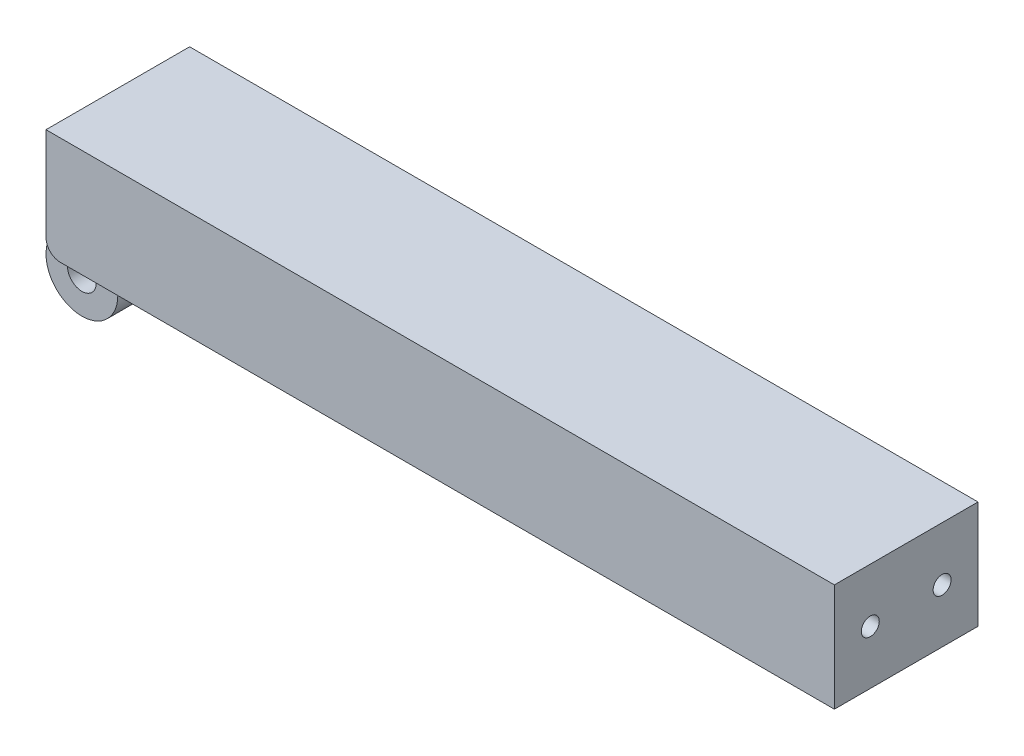
ISO-10303-21;
HEADER;
FILE_DESCRIPTION(('STEP AP214'),'2;1');
FILE_NAME('part.step','',(''),(''),'','','');
FILE_SCHEMA(('AUTOMOTIVE_DESIGN { 1 0 10303 214 1 1 1 1 }'));
ENDSEC;
DATA;
#1=APPLICATION_CONTEXT('core data for automotive mechanical design processes');
#2=APPLICATION_PROTOCOL_DEFINITION('international standard','automotive_design',2000,#1);
#3=PRODUCT_CONTEXT('',#1,'mechanical');
#4=PRODUCT('Part','Part','',(#3));
#5=PRODUCT_RELATED_PRODUCT_CATEGORY('part','',(#4));
#6=PRODUCT_DEFINITION_FORMATION('','',#4);
#7=PRODUCT_DEFINITION_CONTEXT('part definition',#1,'design');
#8=PRODUCT_DEFINITION('design','',#6,#7);
#9=PRODUCT_DEFINITION_SHAPE('','',#8);
#10=(LENGTH_UNIT() NAMED_UNIT(*) SI_UNIT(.MILLI.,.METRE.));
#11=(NAMED_UNIT(*) PLANE_ANGLE_UNIT() SI_UNIT($,.RADIAN.));
#12=(NAMED_UNIT(*) SI_UNIT($,.STERADIAN.) SOLID_ANGLE_UNIT());
#13=UNCERTAINTY_MEASURE_WITH_UNIT(LENGTH_MEASURE(1.E-05),#10,'distance_accuracy_value','');
#14=(GEOMETRIC_REPRESENTATION_CONTEXT(3) GLOBAL_UNCERTAINTY_ASSIGNED_CONTEXT((#13)) GLOBAL_UNIT_ASSIGNED_CONTEXT((#10,
#11,#12)) REPRESENTATION_CONTEXT('',''));
#15=CARTESIAN_POINT('',(0.,0.,0.));
#16=DIRECTION('',(0.,0.,1.));
#17=DIRECTION('',(1.,0.,0.));
#18=AXIS2_PLACEMENT_3D('',#15,#16,#17);
#19=CARTESIAN_POINT('',(109.8,-17.51,10.));
#20=DIRECTION('',(1.,0.,0.));
#21=DIRECTION('',(0.,0.,-1.));
#22=AXIS2_PLACEMENT_3D('',#19,#20,#21);
#23=PLANE('',#22);
#24=DIRECTION('',(0.,-1.,0.));
#25=VECTOR('',#24,1.);
#26=CARTESIAN_POINT('',(109.8,7.5,10.));
#27=LINE('',#26,#25);
#28=CARTESIAN_POINT('',(109.8,7.5,10.));
#29=VERTEX_POINT('',#28);
#30=CARTESIAN_POINT('',(109.8,-7.5,10.));
#31=VERTEX_POINT('',#30);
#32=EDGE_CURVE('E48',#29,#31,#27,.T.);
#33=ORIENTED_EDGE('',*,*,#32,.T.);
#34=DIRECTION('',(0.,0.,-1.));
#35=VECTOR('',#34,1.);
#36=CARTESIAN_POINT('',(109.8,-7.5,10.));
#37=LINE('',#36,#35);
#38=CARTESIAN_POINT('',(109.8,-7.5,-10.));
#39=VERTEX_POINT('',#38);
#40=EDGE_CURVE('E292',#31,#39,#37,.T.);
#41=ORIENTED_EDGE('',*,*,#40,.T.);
#42=DIRECTION('',(0.,1.,0.));
#43=VECTOR('',#42,1.);
#44=CARTESIAN_POINT('',(109.8,-7.5,-10.));
#45=LINE('',#44,#43);
#46=CARTESIAN_POINT('',(109.8,7.5,-10.));
#47=VERTEX_POINT('',#46);
#48=EDGE_CURVE('E145',#39,#47,#45,.T.);
#49=ORIENTED_EDGE('',*,*,#48,.T.);
#50=DIRECTION('',(0.,0.,1.));
#51=VECTOR('',#50,1.);
#52=CARTESIAN_POINT('',(109.8,7.5,10.));
#53=LINE('',#52,#51);
#54=EDGE_CURVE('E289',#47,#29,#53,.T.);
#55=ORIENTED_EDGE('',*,*,#54,.T.);
#56=EDGE_LOOP('',(#33,#41,#49,#55));
#57=FACE_BOUND('',#56,.T.);
#58=CARTESIAN_POINT('',(109.8,0.,-5.00000000000001));
#59=DIRECTION('',(1.,0.,0.));
#60=DIRECTION('',(0.,0.,-1.));
#61=AXIS2_PLACEMENT_3D('',#58,#59,#60);
#62=CIRCLE('',#61,1.24999999999999);
#63=CARTESIAN_POINT('',(109.8,0.,-6.25));
#64=VERTEX_POINT('',#63);
#65=EDGE_CURVE('E295',#64,#64,#62,.F.);
#66=ORIENTED_EDGE('',*,*,#65,.T.);
#67=EDGE_LOOP('',(#66));
#68=FACE_BOUND('',#67,.T.);
#69=CARTESIAN_POINT('',(109.8,0.,5.));
#70=DIRECTION('',(1.,0.,0.));
#71=DIRECTION('',(0.,0.,-1.));
#72=AXIS2_PLACEMENT_3D('',#69,#70,#71);
#73=CIRCLE('',#72,1.24999999999999);
#74=CARTESIAN_POINT('',(109.8,0.,3.75000000000001));
#75=VERTEX_POINT('',#74);
#76=EDGE_CURVE('E137',#75,#75,#73,.F.);
#77=ORIENTED_EDGE('',*,*,#76,.T.);
#78=EDGE_LOOP('',(#77));
#79=FACE_BOUND('',#78,.T.);
#80=ADVANCED_FACE('F44',(#57,#68,#79),#23,.T.);
#81=CARTESIAN_POINT('',(100.8,0.,5.));
#82=DIRECTION('',(1.,0.,0.));
#83=DIRECTION('',(0.,0.,-1.));
#84=AXIS2_PLACEMENT_3D('',#81,#82,#83);
#85=CONICAL_SURFACE('',#84,1.25,1.02974425867666);
#86=CARTESIAN_POINT('',(100.048924226216,0.,5.));
#87=VERTEX_POINT('',#86);
#88=VERTEX_LOOP('',#87);
#89=FACE_BOUND('',#88,.T.);
#90=CARTESIAN_POINT('',(100.8,0.,5.));
#91=DIRECTION('',(1.,0.,0.));
#92=DIRECTION('',(0.,0.,-1.));
#93=AXIS2_PLACEMENT_3D('',#90,#91,#92);
#94=CIRCLE('',#93,1.25);
#95=CARTESIAN_POINT('',(100.8,0.,3.75));
#96=VERTEX_POINT('',#95);
#97=EDGE_CURVE('E216',#96,#96,#94,.T.);
#98=ORIENTED_EDGE('',*,*,#97,.T.);
#99=EDGE_LOOP('',(#98));
#100=FACE_BOUND('',#99,.T.);
#101=ADVANCED_FACE('F361',(#89,#100),#85,.F.);
#102=CARTESIAN_POINT('',(115.8,0.,5.));
#103=DIRECTION('',(1.,0.,0.));
#104=DIRECTION('',(0.,0.,-1.));
#105=AXIS2_PLACEMENT_3D('',#102,#103,#104);
#106=CYLINDRICAL_SURFACE('',#105,1.24999999999999);
#107=ORIENTED_EDGE('',*,*,#97,.F.);
#108=EDGE_LOOP('',(#107));
#109=FACE_BOUND('',#108,.T.);
#110=ORIENTED_EDGE('',*,*,#76,.F.);
#111=EDGE_LOOP('',(#110));
#112=FACE_BOUND('',#111,.T.);
#113=ADVANCED_FACE('F363',(#109,#112),#106,.F.);
#114=CARTESIAN_POINT('',(100.8,0.,-5.00000000000001));
#115=DIRECTION('',(1.,0.,0.));
#116=DIRECTION('',(0.,0.,-1.));
#117=AXIS2_PLACEMENT_3D('',#114,#115,#116);
#118=CONICAL_SURFACE('',#117,1.25,1.02974425867666);
#119=CARTESIAN_POINT('',(100.048924226216,0.,-5.00000000000001));
#120=VERTEX_POINT('',#119);
#121=VERTEX_LOOP('',#120);
#122=FACE_BOUND('',#121,.T.);
#123=CARTESIAN_POINT('',(100.8,0.,-5.00000000000001));
#124=DIRECTION('',(1.,0.,0.));
#125=DIRECTION('',(0.,0.,-1.));
#126=AXIS2_PLACEMENT_3D('',#123,#124,#125);
#127=CIRCLE('',#126,1.25);
#128=CARTESIAN_POINT('',(100.8,0.,-6.25));
#129=VERTEX_POINT('',#128);
#130=EDGE_CURVE('E211',#129,#129,#127,.T.);
#131=ORIENTED_EDGE('',*,*,#130,.T.);
#132=EDGE_LOOP('',(#131));
#133=FACE_BOUND('',#132,.T.);
#134=ADVANCED_FACE('F369',(#122,#133),#118,.F.);
#135=CARTESIAN_POINT('',(115.8,0.,-5.00000000000001));
#136=DIRECTION('',(1.,0.,0.));
#137=DIRECTION('',(0.,0.,-1.));
#138=AXIS2_PLACEMENT_3D('',#135,#136,#137);
#139=CYLINDRICAL_SURFACE('',#138,1.24999999999999);
#140=ORIENTED_EDGE('',*,*,#130,.F.);
#141=EDGE_LOOP('',(#140));
#142=FACE_BOUND('',#141,.T.);
#143=ORIENTED_EDGE('',*,*,#65,.F.);
#144=EDGE_LOOP('',(#143));
#145=FACE_BOUND('',#144,.T.);
#146=ADVANCED_FACE('F471',(#142,#145),#139,.F.);
#147=CARTESIAN_POINT('',(115.8,-7.5,-10.));
#148=DIRECTION('',(0.,0.,1.));
#149=DIRECTION('',(1.,0.,0.));
#150=AXIS2_PLACEMENT_3D('',#147,#148,#149);
#151=PLANE('',#150);
#152=ORIENTED_EDGE('',*,*,#48,.F.);
#153=DIRECTION('',(-1.,0.,0.));
#154=VECTOR('',#153,1.);
#155=CARTESIAN_POINT('',(115.8,-7.5,-10.));
#156=LINE('',#155,#154);
#157=CARTESIAN_POINT('',(2.00000000000003,-7.5,-10.));
#158=VERTEX_POINT('',#157);
#159=EDGE_CURVE('E180',#39,#158,#156,.T.);
#160=ORIENTED_EDGE('',*,*,#159,.T.);
#161=CARTESIAN_POINT('',(2.,-5.5,-10.));
#162=DIRECTION('',(0.,0.,1.));
#163=DIRECTION('',(1.,0.,0.));
#164=AXIS2_PLACEMENT_3D('',#161,#162,#163);
#165=CIRCLE('',#164,2.);
#166=CARTESIAN_POINT('',(0.,-5.5,-10.));
#167=VERTEX_POINT('',#166);
#168=EDGE_CURVE('E166',#158,#167,#165,.F.);
#169=ORIENTED_EDGE('',*,*,#168,.T.);
#170=DIRECTION('',(0.,1.,0.));
#171=VECTOR('',#170,1.);
#172=CARTESIAN_POINT('',(0.,-7.5,-10.));
#173=LINE('',#172,#171);
#174=CARTESIAN_POINT('',(0.,7.5,-10.));
#175=VERTEX_POINT('',#174);
#176=EDGE_CURVE('E187',#167,#175,#173,.T.);
#177=ORIENTED_EDGE('',*,*,#176,.T.);
#178=DIRECTION('',(-1.,0.,0.));
#179=VECTOR('',#178,1.);
#180=CARTESIAN_POINT('',(115.8,7.5,-10.));
#181=LINE('',#180,#179);
#182=EDGE_CURVE('E174',#47,#175,#181,.T.);
#183=ORIENTED_EDGE('',*,*,#182,.F.);
#184=EDGE_LOOP('',(#152,#160,#169,#177,#183));
#185=FACE_BOUND('',#184,.T.);
#186=ADVANCED_FACE('F303',(#185),#151,.F.);
#187=CARTESIAN_POINT('',(115.8,7.5,10.));
#188=DIRECTION('',(0.,-1.,0.));
#189=DIRECTION('',(0.,0.,-1.));
#190=AXIS2_PLACEMENT_3D('',#187,#188,#189);
#191=PLANE('',#190);
#192=ORIENTED_EDGE('',*,*,#54,.F.);
#193=ORIENTED_EDGE('',*,*,#182,.T.);
#194=DIRECTION('',(0.,0.,1.));
#195=VECTOR('',#194,1.);
#196=CARTESIAN_POINT('',(0.,7.5,10.));
#197=LINE('',#196,#195);
#198=CARTESIAN_POINT('',(0.,7.5,10.));
#199=VERTEX_POINT('',#198);
#200=EDGE_CURVE('E184',#175,#199,#197,.T.);
#201=ORIENTED_EDGE('',*,*,#200,.T.);
#202=DIRECTION('',(-1.,0.,0.));
#203=VECTOR('',#202,1.);
#204=CARTESIAN_POINT('',(115.8,7.5,10.));
#205=LINE('',#204,#203);
#206=EDGE_CURVE('E175',#29,#199,#205,.T.);
#207=ORIENTED_EDGE('',*,*,#206,.F.);
#208=EDGE_LOOP('',(#192,#193,#201,#207));
#209=FACE_BOUND('',#208,.T.);
#210=ADVANCED_FACE('F335',(#209),#191,.F.);
#211=CARTESIAN_POINT('',(115.8,-7.5,10.));
#212=DIRECTION('',(0.,1.,0.));
#213=DIRECTION('',(0.,0.,1.));
#214=AXIS2_PLACEMENT_3D('',#211,#212,#213);
#215=PLANE('',#214);
#216=CARTESIAN_POINT('',(40.,-7.5,0.));
#217=DIRECTION('',(0.,-1.,0.));
#218=DIRECTION('',(0.,0.,-1.));
#219=AXIS2_PLACEMENT_3D('',#216,#217,#218);
#220=CIRCLE('',#219,2.1);
#221=CARTESIAN_POINT('',(40.,-7.5,-2.1));
#222=VERTEX_POINT('',#221);
#223=EDGE_CURVE('E134',#222,#222,#220,.T.);
#224=ORIENTED_EDGE('',*,*,#223,.F.);
#225=EDGE_LOOP('',(#224));
#226=FACE_BOUND('',#225,.T.);
#227=ORIENTED_EDGE('',*,*,#40,.F.);
#228=DIRECTION('',(-1.,0.,0.));
#229=VECTOR('',#228,1.);
#230=CARTESIAN_POINT('',(115.8,-7.5,10.));
#231=LINE('',#230,#229);
#232=CARTESIAN_POINT('',(2.00000000000003,-7.5,10.));
#233=VERTEX_POINT('',#232);
#234=EDGE_CURVE('E177',#31,#233,#231,.T.);
#235=ORIENTED_EDGE('',*,*,#234,.T.);
#236=DIRECTION('',(0.,0.,-1.));
#237=VECTOR('',#236,1.);
#238=CARTESIAN_POINT('',(2.,-7.5,5.));
#239=LINE('',#238,#237);
#240=CARTESIAN_POINT('',(2.,-7.5,5.));
#241=VERTEX_POINT('',#240);
#242=EDGE_CURVE('E171',#233,#241,#239,.T.);
#243=ORIENTED_EDGE('',*,*,#242,.T.);
#244=DIRECTION('',(-1.,0.,0.));
#245=VECTOR('',#244,1.);
#246=CARTESIAN_POINT('',(0.,-7.5,5.));
#247=LINE('',#246,#245);
#248=CARTESIAN_POINT('',(9.99999999999999,-7.5,5.));
#249=VERTEX_POINT('',#248);
#250=EDGE_CURVE('E196',#249,#241,#247,.T.);
#251=ORIENTED_EDGE('',*,*,#250,.F.);
#252=DIRECTION('',(0.,0.,-1.));
#253=VECTOR('',#252,1.);
#254=CARTESIAN_POINT('',(9.99999999999999,-7.5,-5.));
#255=LINE('',#254,#253);
#256=CARTESIAN_POINT('',(9.99999999999999,-7.5,-5.));
#257=VERTEX_POINT('',#256);
#258=EDGE_CURVE('E147',#249,#257,#255,.T.);
#259=ORIENTED_EDGE('',*,*,#258,.T.);
#260=DIRECTION('',(-1.,0.,0.));
#261=VECTOR('',#260,1.);
#262=CARTESIAN_POINT('',(0.,-7.5,-5.));
#263=LINE('',#262,#261);
#264=CARTESIAN_POINT('',(2.,-7.5,-5.));
#265=VERTEX_POINT('',#264);
#266=EDGE_CURVE('E197',#257,#265,#263,.T.);
#267=ORIENTED_EDGE('',*,*,#266,.T.);
#268=DIRECTION('',(0.,0.,-1.));
#269=VECTOR('',#268,1.);
#270=CARTESIAN_POINT('',(2.,-7.5,-10.));
#271=LINE('',#270,#269);
#272=EDGE_CURVE('E168',#265,#158,#271,.T.);
#273=ORIENTED_EDGE('',*,*,#272,.T.);
#274=ORIENTED_EDGE('',*,*,#159,.F.);
#275=EDGE_LOOP('',(#227,#235,#243,#251,#259,#267,#273,#274));
#276=FACE_BOUND('',#275,.T.);
#277=ADVANCED_FACE('F46',(#226,#276),#215,.F.);
#278=CARTESIAN_POINT('',(115.8,-7.5,10.));
#279=DIRECTION('',(0.,0.,-1.));
#280=DIRECTION('',(-1.,0.,0.));
#281=AXIS2_PLACEMENT_3D('',#278,#279,#280);
#282=PLANE('',#281);
#283=DIRECTION('',(0.,-1.,0.));
#284=VECTOR('',#283,1.);
#285=CARTESIAN_POINT('',(0.,-7.5,10.));
#286=LINE('',#285,#284);
#287=CARTESIAN_POINT('',(0.,-5.5,10.));
#288=VERTEX_POINT('',#287);
#289=EDGE_CURVE('E181',#199,#288,#286,.T.);
#290=ORIENTED_EDGE('',*,*,#289,.T.);
#291=CARTESIAN_POINT('',(2.,-5.5,10.));
#292=DIRECTION('',(0.,0.,-1.));
#293=DIRECTION('',(-1.,0.,0.));
#294=AXIS2_PLACEMENT_3D('',#291,#292,#293);
#295=CIRCLE('',#294,2.);
#296=EDGE_CURVE('E154',#288,#233,#295,.F.);
#297=ORIENTED_EDGE('',*,*,#296,.T.);
#298=ORIENTED_EDGE('',*,*,#234,.F.);
#299=ORIENTED_EDGE('',*,*,#32,.F.);
#300=ORIENTED_EDGE('',*,*,#206,.T.);
#301=EDGE_LOOP('',(#290,#297,#298,#299,#300));
#302=FACE_BOUND('',#301,.T.);
#303=ADVANCED_FACE('F337',(#302),#282,.F.);
#304=CARTESIAN_POINT('',(0.,0.,0.));
#305=DIRECTION('',(-1.,0.,0.));
#306=DIRECTION('',(0.,0.,1.));
#307=AXIS2_PLACEMENT_3D('',#304,#305,#306);
#308=PLANE('',#307);
#309=CARTESIAN_POINT('',(0.,-3.,2.5));
#310=DIRECTION('',(-1.,0.,0.));
#311=DIRECTION('',(0.,0.,1.));
#312=AXIS2_PLACEMENT_3D('',#309,#310,#311);
#313=CIRCLE('',#312,1.5);
#314=CARTESIAN_POINT('',(0.,-3.,4.));
#315=VERTEX_POINT('',#314);
#316=EDGE_CURVE('E254',#315,#315,#313,.T.);
#317=ORIENTED_EDGE('',*,*,#316,.F.);
#318=EDGE_LOOP('',(#317));
#319=FACE_BOUND('',#318,.T.);
#320=CARTESIAN_POINT('',(0.,-3.,-2.49999999999999));
#321=DIRECTION('',(-1.,0.,0.));
#322=DIRECTION('',(0.,0.,1.));
#323=AXIS2_PLACEMENT_3D('',#320,#321,#322);
#324=CIRCLE('',#323,1.5);
#325=CARTESIAN_POINT('',(0.,-3.,-0.999999999999991));
#326=VERTEX_POINT('',#325);
#327=EDGE_CURVE('E260',#326,#326,#324,.T.);
#328=ORIENTED_EDGE('',*,*,#327,.F.);
#329=EDGE_LOOP('',(#328));
#330=FACE_BOUND('',#329,.T.);
#331=CARTESIAN_POINT('',(0.,1.,7.5));
#332=DIRECTION('',(-1.,0.,0.));
#333=DIRECTION('',(0.,0.,1.));
#334=AXIS2_PLACEMENT_3D('',#331,#332,#333);
#335=CIRCLE('',#334,1.5);
#336=CARTESIAN_POINT('',(0.,1.,9.));
#337=VERTEX_POINT('',#336);
#338=EDGE_CURVE('E266',#337,#337,#335,.T.);
#339=ORIENTED_EDGE('',*,*,#338,.F.);
#340=EDGE_LOOP('',(#339));
#341=FACE_BOUND('',#340,.T.);
#342=CARTESIAN_POINT('',(0.,1.,2.5));
#343=DIRECTION('',(-1.,0.,0.));
#344=DIRECTION('',(0.,0.,1.));
#345=AXIS2_PLACEMENT_3D('',#342,#343,#344);
#346=CIRCLE('',#345,1.5);
#347=CARTESIAN_POINT('',(0.,1.,4.));
#348=VERTEX_POINT('',#347);
#349=EDGE_CURVE('E241',#348,#348,#346,.T.);
#350=ORIENTED_EDGE('',*,*,#349,.F.);
#351=EDGE_LOOP('',(#350));
#352=FACE_BOUND('',#351,.T.);
#353=CARTESIAN_POINT('',(0.,5.,-2.49999999999999));
#354=DIRECTION('',(-1.,0.,0.));
#355=DIRECTION('',(0.,0.,1.));
#356=AXIS2_PLACEMENT_3D('',#353,#354,#355);
#357=CIRCLE('',#356,1.5);
#358=CARTESIAN_POINT('',(0.,5.,-0.999999999999991));
#359=VERTEX_POINT('',#358);
#360=EDGE_CURVE('E223',#359,#359,#357,.T.);
#361=ORIENTED_EDGE('',*,*,#360,.F.);
#362=EDGE_LOOP('',(#361));
#363=FACE_BOUND('',#362,.T.);
#364=CARTESIAN_POINT('',(0.,5.,2.5));
#365=DIRECTION('',(-1.,0.,0.));
#366=DIRECTION('',(0.,0.,1.));
#367=AXIS2_PLACEMENT_3D('',#364,#365,#366);
#368=CIRCLE('',#367,1.5);
#369=CARTESIAN_POINT('',(0.,5.,4.00000000000001));
#370=VERTEX_POINT('',#369);
#371=EDGE_CURVE('E230',#370,#370,#368,.T.);
#372=ORIENTED_EDGE('',*,*,#371,.F.);
#373=EDGE_LOOP('',(#372));
#374=FACE_BOUND('',#373,.T.);
#375=CARTESIAN_POINT('',(0.,5.,7.5));
#376=DIRECTION('',(-1.,0.,0.));
#377=DIRECTION('',(0.,0.,1.));
#378=AXIS2_PLACEMENT_3D('',#375,#376,#377);
#379=CIRCLE('',#378,1.5);
#380=CARTESIAN_POINT('',(0.,5.,9.));
#381=VERTEX_POINT('',#380);
#382=EDGE_CURVE('E229',#381,#381,#379,.T.);
#383=ORIENTED_EDGE('',*,*,#382,.F.);
#384=EDGE_LOOP('',(#383));
#385=FACE_BOUND('',#384,.T.);
#386=CARTESIAN_POINT('',(0.,1.,-2.49999999999999));
#387=DIRECTION('',(-1.,0.,0.));
#388=DIRECTION('',(0.,0.,1.));
#389=AXIS2_PLACEMENT_3D('',#386,#387,#388);
#390=CIRCLE('',#389,1.5);
#391=CARTESIAN_POINT('',(0.,1.,-0.999999999999991));
#392=VERTEX_POINT('',#391);
#393=EDGE_CURVE('E242',#392,#392,#390,.T.);
#394=ORIENTED_EDGE('',*,*,#393,.F.);
#395=EDGE_LOOP('',(#394));
#396=FACE_BOUND('',#395,.T.);
#397=CARTESIAN_POINT('',(0.,-3.,-7.49999999999999));
#398=DIRECTION('',(-1.,0.,0.));
#399=DIRECTION('',(0.,0.,1.));
#400=AXIS2_PLACEMENT_3D('',#397,#398,#399);
#401=CIRCLE('',#400,1.5);
#402=CARTESIAN_POINT('',(0.,-3.,-5.99999999999999));
#403=VERTEX_POINT('',#402);
#404=EDGE_CURVE('E53',#403,#403,#401,.T.);
#405=ORIENTED_EDGE('',*,*,#404,.F.);
#406=EDGE_LOOP('',(#405));
#407=FACE_BOUND('',#406,.T.);
#408=CARTESIAN_POINT('',(0.,1.,-7.49999999999999));
#409=DIRECTION('',(-1.,0.,0.));
#410=DIRECTION('',(0.,0.,1.));
#411=AXIS2_PLACEMENT_3D('',#408,#409,#410);
#412=CIRCLE('',#411,1.5);
#413=CARTESIAN_POINT('',(0.,1.,-5.99999999999999));
#414=VERTEX_POINT('',#413);
#415=EDGE_CURVE('E277',#414,#414,#412,.T.);
#416=ORIENTED_EDGE('',*,*,#415,.F.);
#417=EDGE_LOOP('',(#416));
#418=FACE_BOUND('',#417,.T.);
#419=CARTESIAN_POINT('',(0.,-3.,7.5));
#420=DIRECTION('',(-1.,0.,0.));
#421=DIRECTION('',(0.,0.,1.));
#422=AXIS2_PLACEMENT_3D('',#419,#420,#421);
#423=CIRCLE('',#422,1.5);
#424=CARTESIAN_POINT('',(0.,-3.,9.));
#425=VERTEX_POINT('',#424);
#426=EDGE_CURVE('E253',#425,#425,#423,.T.);
#427=ORIENTED_EDGE('',*,*,#426,.F.);
#428=EDGE_LOOP('',(#427));
#429=FACE_BOUND('',#428,.T.);
#430=CARTESIAN_POINT('',(0.,5.,-7.49999999999999));
#431=DIRECTION('',(-1.,0.,0.));
#432=DIRECTION('',(0.,0.,1.));
#433=AXIS2_PLACEMENT_3D('',#430,#431,#432);
#434=CIRCLE('',#433,1.5);
#435=CARTESIAN_POINT('',(0.,5.,-5.99999999999999));
#436=VERTEX_POINT('',#435);
#437=EDGE_CURVE('E220',#436,#436,#434,.T.);
#438=ORIENTED_EDGE('',*,*,#437,.F.);
#439=EDGE_LOOP('',(#438));
#440=FACE_BOUND('',#439,.T.);
#441=ORIENTED_EDGE('',*,*,#176,.F.);
#442=DIRECTION('',(0.,0.,-1.));
#443=VECTOR('',#442,1.);
#444=CARTESIAN_POINT('',(0.,-5.5,-5.));
#445=LINE('',#444,#443);
#446=CARTESIAN_POINT('',(0.,-5.5,-5.));
#447=VERTEX_POINT('',#446);
#448=EDGE_CURVE('E156',#167,#447,#445,.F.);
#449=ORIENTED_EDGE('',*,*,#448,.T.);
#450=DIRECTION('',(0.,-1.,0.));
#451=VECTOR('',#450,1.);
#452=CARTESIAN_POINT('',(0.,-12.5,-5.));
#453=LINE('',#452,#451);
#454=CARTESIAN_POINT('',(0.,-7.5,-5.));
#455=VERTEX_POINT('',#454);
#456=EDGE_CURVE('E159',#447,#455,#453,.T.);
#457=ORIENTED_EDGE('',*,*,#456,.T.);
#458=DIRECTION('',(0.,0.,-1.));
#459=VECTOR('',#458,1.);
#460=CARTESIAN_POINT('',(0.,-7.5,5.));
#461=LINE('',#460,#459);
#462=CARTESIAN_POINT('',(0.,-7.5,5.));
#463=VERTEX_POINT('',#462);
#464=EDGE_CURVE('E193',#463,#455,#461,.T.);
#465=ORIENTED_EDGE('',*,*,#464,.F.);
#466=DIRECTION('',(0.,1.,0.));
#467=VECTOR('',#466,1.);
#468=CARTESIAN_POINT('',(0.,0.,5.));
#469=LINE('',#468,#467);
#470=CARTESIAN_POINT('',(0.,-5.5,5.));
#471=VERTEX_POINT('',#470);
#472=EDGE_CURVE('E161',#463,#471,#469,.T.);
#473=ORIENTED_EDGE('',*,*,#472,.T.);
#474=DIRECTION('',(0.,0.,-1.));
#475=VECTOR('',#474,1.);
#476=CARTESIAN_POINT('',(0.,-5.5,10.));
#477=LINE('',#476,#475);
#478=EDGE_CURVE('E164',#471,#288,#477,.F.);
#479=ORIENTED_EDGE('',*,*,#478,.T.);
#480=ORIENTED_EDGE('',*,*,#289,.F.);
#481=ORIENTED_EDGE('',*,*,#200,.F.);
#482=EDGE_LOOP('',(#441,#449,#457,#465,#473,#479,#480,#481));
#483=FACE_BOUND('',#482,.T.);
#484=ADVANCED_FACE('F327',(#319,#330,#341,#352,#363,#374,#385,#396,#407,#418,#429,#440,#483),
#308,.T.);
#485=CARTESIAN_POINT('',(0.,-12.5,5.));
#486=DIRECTION('',(0.,0.,1.));
#487=DIRECTION('',(1.,0.,0.));
#488=AXIS2_PLACEMENT_3D('',#485,#486,#487);
#489=PLANE('',#488);
#490=CARTESIAN_POINT('',(0.,-12.5,5.));
#491=DIRECTION('',(0.,0.,1.));
#492=DIRECTION('',(1.,0.,0.));
#493=AXIS2_PLACEMENT_3D('',#490,#491,#492);
#494=CIRCLE('',#493,5.);
#495=CARTESIAN_POINT('',(5.,-12.5,5.));
#496=VERTEX_POINT('',#495);
#497=EDGE_CURVE('E201',#463,#496,#494,.T.);
#498=ORIENTED_EDGE('',*,*,#497,.T.);
#499=CARTESIAN_POINT('',(9.99999999999999,-12.5,5.));
#500=DIRECTION('',(0.,0.,1.));
#501=DIRECTION('',(1.,0.,0.));
#502=AXIS2_PLACEMENT_3D('',#499,#500,#501);
#503=CIRCLE('',#502,5.);
#504=EDGE_CURVE('E141',#496,#249,#503,.F.);
#505=ORIENTED_EDGE('',*,*,#504,.T.);
#506=ORIENTED_EDGE('',*,*,#250,.T.);
#507=CARTESIAN_POINT('',(2.,-5.5,5.));
#508=DIRECTION('',(0.,0.,1.));
#509=DIRECTION('',(1.,0.,0.));
#510=AXIS2_PLACEMENT_3D('',#507,#508,#509);
#511=CIRCLE('',#510,2.);
#512=EDGE_CURVE('E150',#241,#471,#511,.F.);
#513=ORIENTED_EDGE('',*,*,#512,.T.);
#514=ORIENTED_EDGE('',*,*,#472,.F.);
#515=EDGE_LOOP('',(#498,#505,#506,#513,#514));
#516=FACE_BOUND('',#515,.T.);
#517=CARTESIAN_POINT('',(0.,-12.5,5.));
#518=DIRECTION('',(0.,0.,1.));
#519=DIRECTION('',(1.,0.,0.));
#520=AXIS2_PLACEMENT_3D('',#517,#518,#519);
#521=CIRCLE('',#520,2.);
#522=CARTESIAN_POINT('',(2.,-12.5,5.));
#523=VERTEX_POINT('',#522);
#524=EDGE_CURVE('E204',#523,#523,#521,.T.);
#525=ORIENTED_EDGE('',*,*,#524,.F.);
#526=EDGE_LOOP('',(#525));
#527=FACE_BOUND('',#526,.T.);
#528=ADVANCED_FACE('F344',(#516,#527),#489,.T.);
#529=CARTESIAN_POINT('',(0.,-12.5,-5.));
#530=DIRECTION('',(0.,0.,1.));
#531=DIRECTION('',(1.,0.,0.));
#532=AXIS2_PLACEMENT_3D('',#529,#530,#531);
#533=PLANE('',#532);
#534=CARTESIAN_POINT('',(0.,-12.5,-5.));
#535=DIRECTION('',(0.,0.,1.));
#536=DIRECTION('',(1.,0.,0.));
#537=AXIS2_PLACEMENT_3D('',#534,#535,#536);
#538=CIRCLE('',#537,5.);
#539=CARTESIAN_POINT('',(5.,-12.5,-5.));
#540=VERTEX_POINT('',#539);
#541=EDGE_CURVE('E200',#455,#540,#538,.T.);
#542=ORIENTED_EDGE('',*,*,#541,.F.);
#543=ORIENTED_EDGE('',*,*,#456,.F.);
#544=CARTESIAN_POINT('',(2.,-5.5,-5.));
#545=DIRECTION('',(0.,0.,1.));
#546=DIRECTION('',(1.,0.,0.));
#547=AXIS2_PLACEMENT_3D('',#544,#545,#546);
#548=CIRCLE('',#547,2.);
#549=EDGE_CURVE('E152',#447,#265,#548,.T.);
#550=ORIENTED_EDGE('',*,*,#549,.T.);
#551=ORIENTED_EDGE('',*,*,#266,.F.);
#552=CARTESIAN_POINT('',(9.99999999999999,-12.5,-5.));
#553=DIRECTION('',(0.,0.,1.));
#554=DIRECTION('',(1.,0.,0.));
#555=AXIS2_PLACEMENT_3D('',#552,#553,#554);
#556=CIRCLE('',#555,5.);
#557=EDGE_CURVE('E144',#257,#540,#556,.T.);
#558=ORIENTED_EDGE('',*,*,#557,.T.);
#559=EDGE_LOOP('',(#542,#543,#550,#551,#558));
#560=FACE_BOUND('',#559,.T.);
#561=CARTESIAN_POINT('',(0.,-12.5,-5.));
#562=DIRECTION('',(0.,0.,1.));
#563=DIRECTION('',(1.,0.,0.));
#564=AXIS2_PLACEMENT_3D('',#561,#562,#563);
#565=CIRCLE('',#564,2.);
#566=CARTESIAN_POINT('',(2.,-12.5,-5.));
#567=VERTEX_POINT('',#566);
#568=EDGE_CURVE('E208',#567,#567,#565,.T.);
#569=ORIENTED_EDGE('',*,*,#568,.T.);
#570=EDGE_LOOP('',(#569));
#571=FACE_BOUND('',#570,.T.);
#572=ADVANCED_FACE('F316',(#560,#571),#533,.F.);
#573=CARTESIAN_POINT('',(0.,-12.5,5.));
#574=DIRECTION('',(0.,0.,-1.));
#575=DIRECTION('',(-1.,0.,0.));
#576=AXIS2_PLACEMENT_3D('',#573,#574,#575);
#577=CYLINDRICAL_SURFACE('',#576,5.);
#578=ORIENTED_EDGE('',*,*,#541,.T.);
#579=DIRECTION('',(0.,0.,-1.));
#580=VECTOR('',#579,1.);
#581=CARTESIAN_POINT('',(5.,-12.5,5.));
#582=LINE('',#581,#580);
#583=EDGE_CURVE('E190',#496,#540,#582,.T.);
#584=ORIENTED_EDGE('',*,*,#583,.F.);
#585=ORIENTED_EDGE('',*,*,#497,.F.);
#586=ORIENTED_EDGE('',*,*,#464,.T.);
#587=EDGE_LOOP('',(#578,#584,#585,#586));
#588=FACE_BOUND('',#587,.T.);
#589=ADVANCED_FACE('F324',(#588),#577,.T.);
#590=CARTESIAN_POINT('',(0.,-12.5,5.));
#591=DIRECTION('',(0.,0.,-1.));
#592=DIRECTION('',(-1.,0.,0.));
#593=AXIS2_PLACEMENT_3D('',#590,#591,#592);
#594=CYLINDRICAL_SURFACE('',#593,2.);
#595=ORIENTED_EDGE('',*,*,#524,.T.);
#596=EDGE_LOOP('',(#595));
#597=FACE_BOUND('',#596,.T.);
#598=ORIENTED_EDGE('',*,*,#568,.F.);
#599=EDGE_LOOP('',(#598));
#600=FACE_BOUND('',#599,.T.);
#601=ADVANCED_FACE('F350',(#597,#600),#594,.F.);
#602=CARTESIAN_POINT('',(2.,-5.5,10.));
#603=DIRECTION('',(0.,0.,1.));
#604=DIRECTION('',(1.,0.,0.));
#605=AXIS2_PLACEMENT_3D('',#602,#603,#604);
#606=CYLINDRICAL_SURFACE('',#605,2.);
#607=ORIENTED_EDGE('',*,*,#549,.F.);
#608=ORIENTED_EDGE('',*,*,#448,.F.);
#609=ORIENTED_EDGE('',*,*,#168,.F.);
#610=ORIENTED_EDGE('',*,*,#272,.F.);
#611=EDGE_LOOP('',(#607,#608,#609,#610));
#612=FACE_BOUND('',#611,.T.);
#613=ADVANCED_FACE('F311',(#612),#606,.T.);
#614=CARTESIAN_POINT('',(2.,-5.5,10.));
#615=DIRECTION('',(0.,0.,1.));
#616=DIRECTION('',(1.,0.,0.));
#617=AXIS2_PLACEMENT_3D('',#614,#615,#616);
#618=CYLINDRICAL_SURFACE('',#617,2.);
#619=ORIENTED_EDGE('',*,*,#296,.F.);
#620=ORIENTED_EDGE('',*,*,#478,.F.);
#621=ORIENTED_EDGE('',*,*,#512,.F.);
#622=ORIENTED_EDGE('',*,*,#242,.F.);
#623=EDGE_LOOP('',(#619,#620,#621,#622));
#624=FACE_BOUND('',#623,.T.);
#625=ADVANCED_FACE('F341',(#624),#618,.T.);
#626=CARTESIAN_POINT('',(9.99999999999999,-12.5,10.));
#627=DIRECTION('',(0.,0.,1.));
#628=DIRECTION('',(1.,0.,0.));
#629=AXIS2_PLACEMENT_3D('',#626,#627,#628);
#630=CYLINDRICAL_SURFACE('',#629,5.);
#631=ORIENTED_EDGE('',*,*,#504,.F.);
#632=ORIENTED_EDGE('',*,*,#583,.T.);
#633=ORIENTED_EDGE('',*,*,#557,.F.);
#634=ORIENTED_EDGE('',*,*,#258,.F.);
#635=EDGE_LOOP('',(#631,#632,#633,#634));
#636=FACE_BOUND('',#635,.T.);
#637=ADVANCED_FACE('F320',(#636),#630,.F.);
#638=CARTESIAN_POINT('',(2.5,5.,-7.49999999999999));
#639=DIRECTION('',(-1.,0.,0.));
#640=DIRECTION('',(0.,0.,1.));
#641=AXIS2_PLACEMENT_3D('',#638,#639,#640);
#642=CYLINDRICAL_SURFACE('',#641,1.5);
#643=CARTESIAN_POINT('',(2.5,5.,-7.49999999999999));
#644=DIRECTION('',(-1.,0.,0.));
#645=DIRECTION('',(0.,0.,1.));
#646=AXIS2_PLACEMENT_3D('',#643,#644,#645);
#647=CIRCLE('',#646,1.5);
#648=CARTESIAN_POINT('',(2.5,5.,-5.99999999999999));
#649=VERTEX_POINT('',#648);
#650=EDGE_CURVE('E219',#649,#649,#647,.T.);
#651=ORIENTED_EDGE('',*,*,#650,.F.);
#652=EDGE_LOOP('',(#651));
#653=FACE_BOUND('',#652,.T.);
#654=ORIENTED_EDGE('',*,*,#437,.T.);
#655=EDGE_LOOP('',(#654));
#656=FACE_BOUND('',#655,.T.);
#657=ADVANCED_FACE('F376',(#653,#656),#642,.F.);
#658=CARTESIAN_POINT('',(2.5,5.,-7.49999999999999));
#659=DIRECTION('',(-1.,0.,0.));
#660=DIRECTION('',(0.,0.,1.));
#661=AXIS2_PLACEMENT_3D('',#658,#659,#660);
#662=PLANE('',#661);
#663=ORIENTED_EDGE('',*,*,#650,.T.);
#664=EDGE_LOOP('',(#663));
#665=FACE_BOUND('',#664,.T.);
#666=ADVANCED_FACE('F379',(#665),#662,.T.);
#667=CARTESIAN_POINT('',(2.5,-3.,7.5));
#668=DIRECTION('',(-1.,0.,0.));
#669=DIRECTION('',(0.,0.,1.));
#670=AXIS2_PLACEMENT_3D('',#667,#668,#669);
#671=CYLINDRICAL_SURFACE('',#670,1.5);
#672=CARTESIAN_POINT('',(2.5,-3.,7.5));
#673=DIRECTION('',(-1.,0.,0.));
#674=DIRECTION('',(0.,0.,1.));
#675=AXIS2_PLACEMENT_3D('',#672,#673,#674);
#676=CIRCLE('',#675,1.5);
#677=CARTESIAN_POINT('',(2.5,-3.,9.));
#678=VERTEX_POINT('',#677);
#679=EDGE_CURVE('E280',#678,#678,#676,.T.);
#680=ORIENTED_EDGE('',*,*,#679,.F.);
#681=EDGE_LOOP('',(#680));
#682=FACE_BOUND('',#681,.T.);
#683=ORIENTED_EDGE('',*,*,#426,.T.);
#684=EDGE_LOOP('',(#683));
#685=FACE_BOUND('',#684,.T.);
#686=ADVANCED_FACE('F383',(#682,#685),#671,.F.);
#687=CARTESIAN_POINT('',(2.5,-3.,7.5));
#688=DIRECTION('',(-1.,0.,0.));
#689=DIRECTION('',(0.,0.,1.));
#690=AXIS2_PLACEMENT_3D('',#687,#688,#689);
#691=PLANE('',#690);
#692=ORIENTED_EDGE('',*,*,#679,.T.);
#693=EDGE_LOOP('',(#692));
#694=FACE_BOUND('',#693,.T.);
#695=ADVANCED_FACE('F457',(#694),#691,.T.);
#696=CARTESIAN_POINT('',(2.5,1.,-7.49999999999999));
#697=DIRECTION('',(-1.,0.,0.));
#698=DIRECTION('',(0.,0.,1.));
#699=AXIS2_PLACEMENT_3D('',#696,#697,#698);
#700=CYLINDRICAL_SURFACE('',#699,1.5);
#701=CARTESIAN_POINT('',(2.5,1.,-7.49999999999999));
#702=DIRECTION('',(-1.,0.,0.));
#703=DIRECTION('',(0.,0.,1.));
#704=AXIS2_PLACEMENT_3D('',#701,#702,#703);
#705=CIRCLE('',#704,1.5);
#706=CARTESIAN_POINT('',(2.5,1.,-5.99999999999999));
#707=VERTEX_POINT('',#706);
#708=EDGE_CURVE('E274',#707,#707,#705,.T.);
#709=ORIENTED_EDGE('',*,*,#708,.F.);
#710=EDGE_LOOP('',(#709));
#711=FACE_BOUND('',#710,.T.);
#712=ORIENTED_EDGE('',*,*,#415,.T.);
#713=EDGE_LOOP('',(#712));
#714=FACE_BOUND('',#713,.T.);
#715=ADVANCED_FACE('F453',(#711,#714),#700,.F.);
#716=CARTESIAN_POINT('',(2.5,1.,-7.49999999999999));
#717=DIRECTION('',(-1.,0.,0.));
#718=DIRECTION('',(0.,0.,1.));
#719=AXIS2_PLACEMENT_3D('',#716,#717,#718);
#720=PLANE('',#719);
#721=ORIENTED_EDGE('',*,*,#708,.T.);
#722=EDGE_LOOP('',(#721));
#723=FACE_BOUND('',#722,.T.);
#724=ADVANCED_FACE('F449',(#723),#720,.T.);
#725=CARTESIAN_POINT('',(2.5,-3.,-7.49999999999999));
#726=DIRECTION('',(-1.,0.,0.));
#727=DIRECTION('',(0.,0.,1.));
#728=AXIS2_PLACEMENT_3D('',#725,#726,#727);
#729=CYLINDRICAL_SURFACE('',#728,1.5);
#730=CARTESIAN_POINT('',(2.5,-3.,-7.49999999999999));
#731=DIRECTION('',(-1.,0.,0.));
#732=DIRECTION('',(0.,0.,1.));
#733=AXIS2_PLACEMENT_3D('',#730,#731,#732);
#734=CIRCLE('',#733,1.5);
#735=CARTESIAN_POINT('',(2.5,-3.,-5.99999999999999));
#736=VERTEX_POINT('',#735);
#737=EDGE_CURVE('E11',#736,#736,#734,.T.);
#738=ORIENTED_EDGE('',*,*,#737,.F.);
#739=EDGE_LOOP('',(#738));
#740=FACE_BOUND('',#739,.T.);
#741=ORIENTED_EDGE('',*,*,#404,.T.);
#742=EDGE_LOOP('',(#741));
#743=FACE_BOUND('',#742,.T.);
#744=ADVANCED_FACE('F452',(#740,#743),#729,.F.);
#745=CARTESIAN_POINT('',(2.5,-3.,-7.49999999999999));
#746=DIRECTION('',(-1.,0.,0.));
#747=DIRECTION('',(0.,0.,1.));
#748=AXIS2_PLACEMENT_3D('',#745,#746,#747);
#749=PLANE('',#748);
#750=ORIENTED_EDGE('',*,*,#737,.T.);
#751=EDGE_LOOP('',(#750));
#752=FACE_BOUND('',#751,.T.);
#753=ADVANCED_FACE('F411',(#752),#749,.T.);
#754=CARTESIAN_POINT('',(2.5,1.,-2.49999999999999));
#755=DIRECTION('',(-1.,0.,0.));
#756=DIRECTION('',(0.,0.,1.));
#757=AXIS2_PLACEMENT_3D('',#754,#755,#756);
#758=CYLINDRICAL_SURFACE('',#757,1.5);
#759=CARTESIAN_POINT('',(2.5,1.,-2.49999999999999));
#760=DIRECTION('',(-1.,0.,0.));
#761=DIRECTION('',(0.,0.,1.));
#762=AXIS2_PLACEMENT_3D('',#759,#760,#761);
#763=CIRCLE('',#762,1.5);
#764=CARTESIAN_POINT('',(2.5,1.,-0.999999999999991));
#765=VERTEX_POINT('',#764);
#766=EDGE_CURVE('E238',#765,#765,#763,.T.);
#767=ORIENTED_EDGE('',*,*,#766,.F.);
#768=EDGE_LOOP('',(#767));
#769=FACE_BOUND('',#768,.T.);
#770=ORIENTED_EDGE('',*,*,#393,.T.);
#771=EDGE_LOOP('',(#770));
#772=FACE_BOUND('',#771,.T.);
#773=ADVANCED_FACE('F407',(#769,#772),#758,.F.);
#774=CARTESIAN_POINT('',(2.5,1.,-2.49999999999999));
#775=DIRECTION('',(-1.,0.,0.));
#776=DIRECTION('',(0.,0.,1.));
#777=AXIS2_PLACEMENT_3D('',#774,#775,#776);
#778=PLANE('',#777);
#779=ORIENTED_EDGE('',*,*,#766,.T.);
#780=EDGE_LOOP('',(#779));
#781=FACE_BOUND('',#780,.T.);
#782=ADVANCED_FACE('F403',(#781),#778,.T.);
#783=CARTESIAN_POINT('',(2.5,5.,7.5));
#784=DIRECTION('',(-1.,0.,0.));
#785=DIRECTION('',(0.,0.,1.));
#786=AXIS2_PLACEMENT_3D('',#783,#784,#785);
#787=CYLINDRICAL_SURFACE('',#786,1.5);
#788=CARTESIAN_POINT('',(2.5,5.,7.5));
#789=DIRECTION('',(-1.,0.,0.));
#790=DIRECTION('',(0.,0.,1.));
#791=AXIS2_PLACEMENT_3D('',#788,#789,#790);
#792=CIRCLE('',#791,1.5);
#793=CARTESIAN_POINT('',(2.5,5.,9.));
#794=VERTEX_POINT('',#793);
#795=EDGE_CURVE('E245',#794,#794,#792,.T.);
#796=ORIENTED_EDGE('',*,*,#795,.F.);
#797=EDGE_LOOP('',(#796));
#798=FACE_BOUND('',#797,.T.);
#799=ORIENTED_EDGE('',*,*,#382,.T.);
#800=EDGE_LOOP('',(#799));
#801=FACE_BOUND('',#800,.T.);
#802=ADVANCED_FACE('F406',(#798,#801),#787,.F.);
#803=CARTESIAN_POINT('',(2.5,5.,7.5));
#804=DIRECTION('',(-1.,0.,0.));
#805=DIRECTION('',(0.,0.,1.));
#806=AXIS2_PLACEMENT_3D('',#803,#804,#805);
#807=PLANE('',#806);
#808=ORIENTED_EDGE('',*,*,#795,.T.);
#809=EDGE_LOOP('',(#808));
#810=FACE_BOUND('',#809,.T.);
#811=ADVANCED_FACE('F393',(#810),#807,.T.);
#812=CARTESIAN_POINT('',(2.5,5.,2.5));
#813=DIRECTION('',(-1.,0.,0.));
#814=DIRECTION('',(0.,0.,1.));
#815=AXIS2_PLACEMENT_3D('',#812,#813,#814);
#816=CYLINDRICAL_SURFACE('',#815,1.5);
#817=CARTESIAN_POINT('',(2.5,5.,2.5));
#818=DIRECTION('',(-1.,0.,0.));
#819=DIRECTION('',(0.,0.,1.));
#820=AXIS2_PLACEMENT_3D('',#817,#818,#819);
#821=CIRCLE('',#820,1.5);
#822=CARTESIAN_POINT('',(2.5,5.,4.00000000000001));
#823=VERTEX_POINT('',#822);
#824=EDGE_CURVE('E226',#823,#823,#821,.T.);
#825=ORIENTED_EDGE('',*,*,#824,.F.);
#826=EDGE_LOOP('',(#825));
#827=FACE_BOUND('',#826,.T.);
#828=ORIENTED_EDGE('',*,*,#371,.T.);
#829=EDGE_LOOP('',(#828));
#830=FACE_BOUND('',#829,.T.);
#831=ADVANCED_FACE('F389',(#827,#830),#816,.F.);
#832=CARTESIAN_POINT('',(2.5,5.,2.5));
#833=DIRECTION('',(-1.,0.,0.));
#834=DIRECTION('',(0.,0.,1.));
#835=AXIS2_PLACEMENT_3D('',#832,#833,#834);
#836=PLANE('',#835);
#837=ORIENTED_EDGE('',*,*,#824,.T.);
#838=EDGE_LOOP('',(#837));
#839=FACE_BOUND('',#838,.T.);
#840=ADVANCED_FACE('F385',(#839),#836,.T.);
#841=CARTESIAN_POINT('',(2.5,5.,-2.49999999999999));
#842=DIRECTION('',(-1.,0.,0.));
#843=DIRECTION('',(0.,0.,1.));
#844=AXIS2_PLACEMENT_3D('',#841,#842,#843);
#845=CYLINDRICAL_SURFACE('',#844,1.5);
#846=CARTESIAN_POINT('',(2.5,5.,-2.49999999999999));
#847=DIRECTION('',(-1.,0.,0.));
#848=DIRECTION('',(0.,0.,1.));
#849=AXIS2_PLACEMENT_3D('',#846,#847,#848);
#850=CIRCLE('',#849,1.5);
#851=CARTESIAN_POINT('',(2.5,5.,-0.999999999999991));
#852=VERTEX_POINT('',#851);
#853=EDGE_CURVE('E233',#852,#852,#850,.T.);
#854=ORIENTED_EDGE('',*,*,#853,.F.);
#855=EDGE_LOOP('',(#854));
#856=FACE_BOUND('',#855,.T.);
#857=ORIENTED_EDGE('',*,*,#360,.T.);
#858=EDGE_LOOP('',(#857));
#859=FACE_BOUND('',#858,.T.);
#860=ADVANCED_FACE('F388',(#856,#859),#845,.F.);
#861=CARTESIAN_POINT('',(2.5,5.,-2.49999999999999));
#862=DIRECTION('',(-1.,0.,0.));
#863=DIRECTION('',(0.,0.,1.));
#864=AXIS2_PLACEMENT_3D('',#861,#862,#863);
#865=PLANE('',#864);
#866=ORIENTED_EDGE('',*,*,#853,.T.);
#867=EDGE_LOOP('',(#866));
#868=FACE_BOUND('',#867,.T.);
#869=ADVANCED_FACE('F395',(#868),#865,.T.);
#870=CARTESIAN_POINT('',(2.5,1.,2.5));
#871=DIRECTION('',(-1.,0.,0.));
#872=DIRECTION('',(0.,0.,1.));
#873=AXIS2_PLACEMENT_3D('',#870,#871,#872);
#874=CYLINDRICAL_SURFACE('',#873,1.5);
#875=CARTESIAN_POINT('',(2.5,1.,2.5));
#876=DIRECTION('',(-1.,0.,0.));
#877=DIRECTION('',(0.,0.,1.));
#878=AXIS2_PLACEMENT_3D('',#875,#876,#877);
#879=CIRCLE('',#878,1.5);
#880=CARTESIAN_POINT('',(2.5,1.,4.));
#881=VERTEX_POINT('',#880);
#882=EDGE_CURVE('E269',#881,#881,#879,.T.);
#883=ORIENTED_EDGE('',*,*,#882,.F.);
#884=EDGE_LOOP('',(#883));
#885=FACE_BOUND('',#884,.T.);
#886=ORIENTED_EDGE('',*,*,#349,.T.);
#887=EDGE_LOOP('',(#886));
#888=FACE_BOUND('',#887,.T.);
#889=ADVANCED_FACE('F398',(#885,#888),#874,.F.);
#890=CARTESIAN_POINT('',(2.5,1.,2.5));
#891=DIRECTION('',(-1.,0.,0.));
#892=DIRECTION('',(0.,0.,1.));
#893=AXIS2_PLACEMENT_3D('',#890,#891,#892);
#894=PLANE('',#893);
#895=ORIENTED_EDGE('',*,*,#882,.T.);
#896=EDGE_LOOP('',(#895));
#897=FACE_BOUND('',#896,.T.);
#898=ADVANCED_FACE('F441',(#897),#894,.T.);
#899=CARTESIAN_POINT('',(2.5,1.,7.5));
#900=DIRECTION('',(-1.,0.,0.));
#901=DIRECTION('',(0.,0.,1.));
#902=AXIS2_PLACEMENT_3D('',#899,#900,#901);
#903=CYLINDRICAL_SURFACE('',#902,1.5);
#904=CARTESIAN_POINT('',(2.5,1.,7.5));
#905=DIRECTION('',(-1.,0.,0.));
#906=DIRECTION('',(0.,0.,1.));
#907=AXIS2_PLACEMENT_3D('',#904,#905,#906);
#908=CIRCLE('',#907,1.5);
#909=CARTESIAN_POINT('',(2.5,1.,9.));
#910=VERTEX_POINT('',#909);
#911=EDGE_CURVE('E263',#910,#910,#908,.T.);
#912=ORIENTED_EDGE('',*,*,#911,.F.);
#913=EDGE_LOOP('',(#912));
#914=FACE_BOUND('',#913,.T.);
#915=ORIENTED_EDGE('',*,*,#338,.T.);
#916=EDGE_LOOP('',(#915));
#917=FACE_BOUND('',#916,.T.);
#918=ADVANCED_FACE('F437',(#914,#917),#903,.F.);
#919=CARTESIAN_POINT('',(2.5,1.,7.5));
#920=DIRECTION('',(-1.,0.,0.));
#921=DIRECTION('',(0.,0.,1.));
#922=AXIS2_PLACEMENT_3D('',#919,#920,#921);
#923=PLANE('',#922);
#924=ORIENTED_EDGE('',*,*,#911,.T.);
#925=EDGE_LOOP('',(#924));
#926=FACE_BOUND('',#925,.T.);
#927=ADVANCED_FACE('F433',(#926),#923,.T.);
#928=CARTESIAN_POINT('',(2.5,-3.,-2.49999999999999));
#929=DIRECTION('',(-1.,0.,0.));
#930=DIRECTION('',(0.,0.,1.));
#931=AXIS2_PLACEMENT_3D('',#928,#929,#930);
#932=CYLINDRICAL_SURFACE('',#931,1.5);
#933=CARTESIAN_POINT('',(2.5,-3.,-2.49999999999999));
#934=DIRECTION('',(-1.,0.,0.));
#935=DIRECTION('',(0.,0.,1.));
#936=AXIS2_PLACEMENT_3D('',#933,#934,#935);
#937=CIRCLE('',#936,1.5);
#938=CARTESIAN_POINT('',(2.5,-3.,-0.999999999999991));
#939=VERTEX_POINT('',#938);
#940=EDGE_CURVE('E257',#939,#939,#937,.T.);
#941=ORIENTED_EDGE('',*,*,#940,.F.);
#942=EDGE_LOOP('',(#941));
#943=FACE_BOUND('',#942,.T.);
#944=ORIENTED_EDGE('',*,*,#327,.T.);
#945=EDGE_LOOP('',(#944));
#946=FACE_BOUND('',#945,.T.);
#947=ADVANCED_FACE('F429',(#943,#946),#932,.F.);
#948=CARTESIAN_POINT('',(2.5,-3.,-2.49999999999999));
#949=DIRECTION('',(-1.,0.,0.));
#950=DIRECTION('',(0.,0.,1.));
#951=AXIS2_PLACEMENT_3D('',#948,#949,#950);
#952=PLANE('',#951);
#953=ORIENTED_EDGE('',*,*,#940,.T.);
#954=EDGE_LOOP('',(#953));
#955=FACE_BOUND('',#954,.T.);
#956=ADVANCED_FACE('F425',(#955),#952,.T.);
#957=CARTESIAN_POINT('',(2.5,-3.,2.5));
#958=DIRECTION('',(-1.,0.,0.));
#959=DIRECTION('',(0.,0.,1.));
#960=AXIS2_PLACEMENT_3D('',#957,#958,#959);
#961=CYLINDRICAL_SURFACE('',#960,1.5);
#962=CARTESIAN_POINT('',(2.5,-3.,2.5));
#963=DIRECTION('',(-1.,0.,0.));
#964=DIRECTION('',(0.,0.,1.));
#965=AXIS2_PLACEMENT_3D('',#962,#963,#964);
#966=CIRCLE('',#965,1.5);
#967=CARTESIAN_POINT('',(2.5,-3.,4.));
#968=VERTEX_POINT('',#967);
#969=EDGE_CURVE('E250',#968,#968,#966,.T.);
#970=ORIENTED_EDGE('',*,*,#969,.F.);
#971=EDGE_LOOP('',(#970));
#972=FACE_BOUND('',#971,.T.);
#973=ORIENTED_EDGE('',*,*,#316,.T.);
#974=EDGE_LOOP('',(#973));
#975=FACE_BOUND('',#974,.T.);
#976=ADVANCED_FACE('F421',(#972,#975),#961,.F.);
#977=CARTESIAN_POINT('',(2.5,-3.,2.5));
#978=DIRECTION('',(-1.,0.,0.));
#979=DIRECTION('',(0.,0.,1.));
#980=AXIS2_PLACEMENT_3D('',#977,#978,#979);
#981=PLANE('',#980);
#982=ORIENTED_EDGE('',*,*,#969,.T.);
#983=EDGE_LOOP('',(#982));
#984=FACE_BOUND('',#983,.T.);
#985=ADVANCED_FACE('F128',(#984),#981,.T.);
#986=CARTESIAN_POINT('',(40.,2.5,0.));
#987=DIRECTION('',(0.,-1.,0.));
#988=DIRECTION('',(0.,0.,-1.));
#989=AXIS2_PLACEMENT_3D('',#986,#987,#988);
#990=CONICAL_SURFACE('',#989,2.1,1.02974425867665);
#991=CARTESIAN_POINT('',(40.,3.76180729995787,0.));
#992=VERTEX_POINT('',#991);
#993=VERTEX_LOOP('',#992);
#994=FACE_BOUND('',#993,.T.);
#995=CARTESIAN_POINT('',(40.,2.5,0.));
#996=DIRECTION('',(0.,-1.,0.));
#997=DIRECTION('',(0.,0.,-1.));
#998=AXIS2_PLACEMENT_3D('',#995,#996,#997);
#999=CIRCLE('',#998,2.1);
#1000=CARTESIAN_POINT('',(40.,2.5,-2.1));
#1001=VERTEX_POINT('',#1000);
#1002=EDGE_CURVE('E132',#1001,#1001,#999,.T.);
#1003=ORIENTED_EDGE('',*,*,#1002,.T.);
#1004=EDGE_LOOP('',(#1003));
#1005=FACE_BOUND('',#1004,.T.);
#1006=ADVANCED_FACE('F124',(#994,#1005),#990,.F.);
#1007=CARTESIAN_POINT('',(40.,-7.5,0.));
#1008=DIRECTION('',(0.,-1.,0.));
#1009=DIRECTION('',(0.,0.,-1.));
#1010=AXIS2_PLACEMENT_3D('',#1007,#1008,#1009);
#1011=CYLINDRICAL_SURFACE('',#1010,2.1);
#1012=ORIENTED_EDGE('',*,*,#1002,.F.);
#1013=EDGE_LOOP('',(#1012));
#1014=FACE_BOUND('',#1013,.T.);
#1015=ORIENTED_EDGE('',*,*,#223,.T.);
#1016=EDGE_LOOP('',(#1015));
#1017=FACE_BOUND('',#1016,.T.);
#1018=ADVANCED_FACE('F127',(#1014,#1017),#1011,.F.);
#1019=CLOSED_SHELL('',(#80,#101,#113,#134,#146,#186,#210,#277,#303,#484,#528,#572,#589,#601,
#613,#625,#637,#657,#666,#686,#695,#715,#724,#744,#753,#773,#782,#802,#811,#831,#840,#860,#869,
#889,#898,#918,#927,#947,#956,#976,#985,#1006,#1018));
#1020=MANIFOLD_SOLID_BREP('B2',#1019);
#1021=ADVANCED_BREP_SHAPE_REPRESENTATION('',(#18,#1020),#14);
#1022=SHAPE_DEFINITION_REPRESENTATION(#9,#1021);
ENDSEC;
END-ISO-10303-21;
